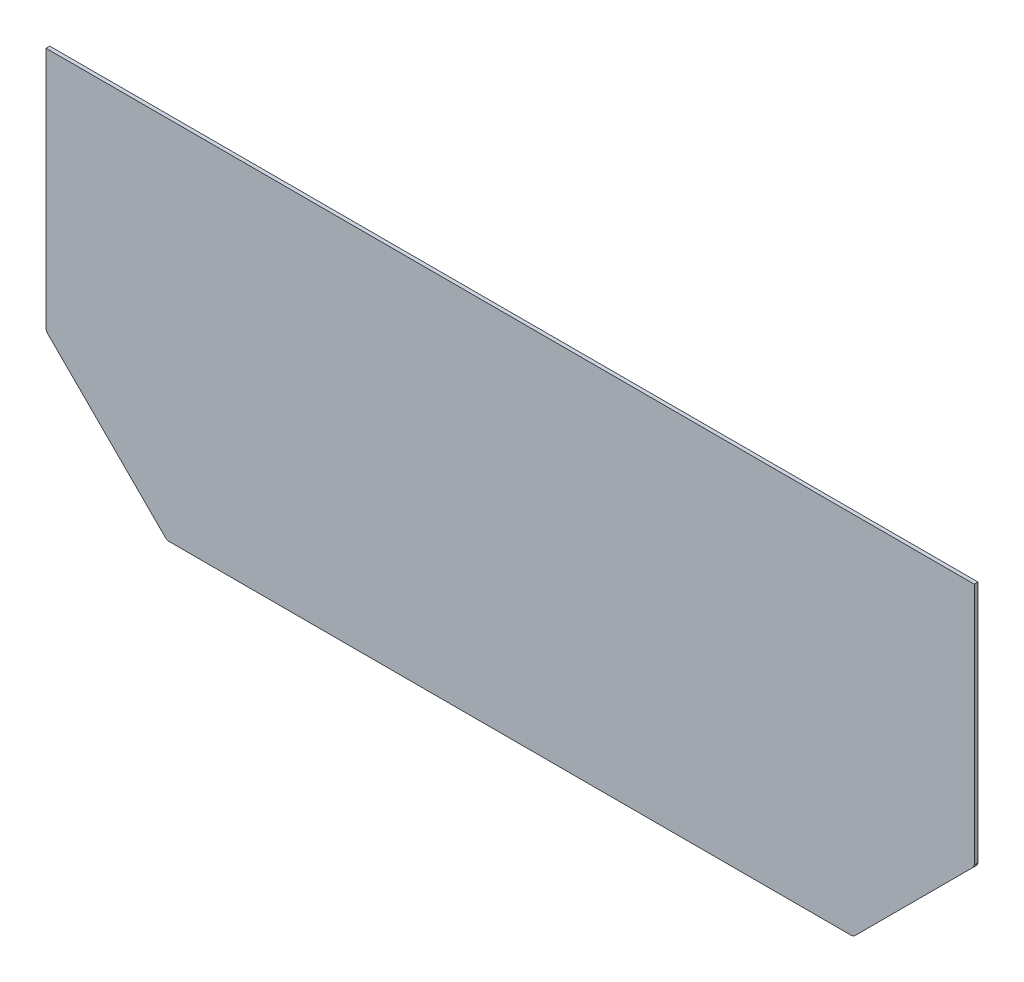
ISO-10303-21;
HEADER;
FILE_DESCRIPTION(('STEP AP214'),'2;1');
FILE_NAME('part.step','',(''),(''),'','','');
FILE_SCHEMA(('AUTOMOTIVE_DESIGN { 1 0 10303 214 1 1 1 1 }'));
ENDSEC;
DATA;
#1=APPLICATION_CONTEXT('core data for automotive mechanical design processes');
#2=APPLICATION_PROTOCOL_DEFINITION('international standard','automotive_design',2000,#1);
#3=PRODUCT_CONTEXT('',#1,'mechanical');
#4=PRODUCT('Part','Part','',(#3));
#5=PRODUCT_RELATED_PRODUCT_CATEGORY('part','',(#4));
#6=PRODUCT_DEFINITION_FORMATION('','',#4);
#7=PRODUCT_DEFINITION_CONTEXT('part definition',#1,'design');
#8=PRODUCT_DEFINITION('design','',#6,#7);
#9=PRODUCT_DEFINITION_SHAPE('','',#8);
#10=(LENGTH_UNIT() NAMED_UNIT(*) SI_UNIT(.MILLI.,.METRE.));
#11=(NAMED_UNIT(*) PLANE_ANGLE_UNIT() SI_UNIT($,.RADIAN.));
#12=(NAMED_UNIT(*) SI_UNIT($,.STERADIAN.) SOLID_ANGLE_UNIT());
#13=UNCERTAINTY_MEASURE_WITH_UNIT(LENGTH_MEASURE(1.E-05),#10,'distance_accuracy_value','');
#14=(GEOMETRIC_REPRESENTATION_CONTEXT(3) GLOBAL_UNCERTAINTY_ASSIGNED_CONTEXT((#13)) GLOBAL_UNIT_ASSIGNED_CONTEXT((#10,
#11,#12)) REPRESENTATION_CONTEXT('',''));
#15=CARTESIAN_POINT('',(0.,0.,0.));
#16=DIRECTION('',(0.,0.,1.));
#17=DIRECTION('',(1.,0.,0.));
#18=AXIS2_PLACEMENT_3D('',#15,#16,#17);
#19=CARTESIAN_POINT('',(-685.090920801277,-304.110479041916,-6.));
#20=DIRECTION('',(-0.382683432365101,-0.923879532511282,0.));
#21=DIRECTION('',(0.923879532511282,-0.382683432365101,0.));
#22=AXIS2_PLACEMENT_3D('',#19,#20,#21);
#23=PLANE('',#22);
#24=DIRECTION('',(0.923879532511282,-0.382683432365101,0.));
#25=VECTOR('',#24,1.);
#26=CARTESIAN_POINT('',(-685.090920801277,-304.110479041916,0.));
#27=LINE('',#26,#25);
#28=CARTESIAN_POINT('',(-689.333561488397,-302.353119729035,0.));
#29=VERTEX_POINT('',#28);
#30=CARTESIAN_POINT('',(-685.090920801277,-304.110479041916,0.));
#31=VERTEX_POINT('',#30);
#32=EDGE_CURVE('E151',#29,#31,#27,.T.);
#33=ORIENTED_EDGE('',*,*,#32,.F.);
#34=DIRECTION('',(0.,0.,1.));
#35=VECTOR('',#34,1.);
#36=CARTESIAN_POINT('',(-689.333561488397,-302.353119729035,-6.));
#37=LINE('',#36,#35);
#38=CARTESIAN_POINT('',(-689.333561488397,-302.353119729035,-6.));
#39=VERTEX_POINT('',#38);
#40=EDGE_CURVE('E11',#39,#29,#37,.T.);
#41=ORIENTED_EDGE('',*,*,#40,.F.);
#42=DIRECTION('',(0.923879532511282,-0.382683432365101,0.));
#43=VECTOR('',#42,1.);
#44=CARTESIAN_POINT('',(-685.090920801277,-304.110479041916,-6.));
#45=LINE('',#44,#43);
#46=CARTESIAN_POINT('',(-685.090920801277,-304.110479041916,-6.));
#47=VERTEX_POINT('',#46);
#48=EDGE_CURVE('E177',#39,#47,#45,.T.);
#49=ORIENTED_EDGE('',*,*,#48,.T.);
#50=DIRECTION('',(0.,0.,1.));
#51=VECTOR('',#50,1.);
#52=CARTESIAN_POINT('',(-685.090920801277,-304.110479041916,-6.));
#53=LINE('',#52,#51);
#54=EDGE_CURVE('E45',#47,#31,#53,.T.);
#55=ORIENTED_EDGE('',*,*,#54,.T.);
#56=EDGE_LOOP('',(#33,#41,#49,#55));
#57=FACE_BOUND('',#56,.T.);
#58=ADVANCED_FACE('F42',(#57),#23,.T.);
#59=CARTESIAN_POINT('',(-689.333561488397,-302.353119729035,-6.));
#60=DIRECTION('',(-0.707106781186548,-0.707106781186547,0.));
#61=DIRECTION('',(0.707106781186547,-0.707106781186548,0.));
#62=AXIS2_PLACEMENT_3D('',#59,#60,#61);
#63=PLANE('',#62);
#64=DIRECTION('',(0.707106781186547,-0.707106781186548,0.));
#65=VECTOR('',#64,1.);
#66=CARTESIAN_POINT('',(-689.333561488397,-302.353119729035,0.));
#67=LINE('',#66,#65);
#68=CARTESIAN_POINT('',(-882.304124236873,-109.382556980558,0.));
#69=VERTEX_POINT('',#68);
#70=EDGE_CURVE('E175',#69,#29,#67,.T.);
#71=ORIENTED_EDGE('',*,*,#70,.F.);
#72=DIRECTION('',(0.,0.,1.));
#73=VECTOR('',#72,1.);
#74=CARTESIAN_POINT('',(-882.304124236873,-109.382556980558,-6.));
#75=LINE('',#74,#73);
#76=CARTESIAN_POINT('',(-882.304124236873,-109.382556980558,-6.));
#77=VERTEX_POINT('',#76);
#78=EDGE_CURVE('E51',#77,#69,#75,.T.);
#79=ORIENTED_EDGE('',*,*,#78,.F.);
#80=DIRECTION('',(0.707106781186547,-0.707106781186548,0.));
#81=VECTOR('',#80,1.);
#82=CARTESIAN_POINT('',(-689.333561488397,-302.353119729035,-6.));
#83=LINE('',#82,#81);
#84=EDGE_CURVE('E141',#77,#39,#83,.T.);
#85=ORIENTED_EDGE('',*,*,#84,.T.);
#86=ORIENTED_EDGE('',*,*,#40,.T.);
#87=EDGE_LOOP('',(#71,#79,#85,#86));
#88=FACE_BOUND('',#87,.T.);
#89=ADVANCED_FACE('F193',(#88),#63,.T.);
#90=CARTESIAN_POINT('',(-882.304124236873,-109.382556980558,-6.));
#91=DIRECTION('',(-0.923879532511294,-0.382683432365072,0.));
#92=DIRECTION('',(0.382683432365072,-0.923879532511294,0.));
#93=AXIS2_PLACEMENT_3D('',#90,#91,#92);
#94=PLANE('',#93);
#95=DIRECTION('',(0.382683432365072,-0.923879532511294,0.));
#96=VECTOR('',#95,1.);
#97=CARTESIAN_POINT('',(-882.304124236873,-109.382556980558,0.));
#98=LINE('',#97,#96);
#99=CARTESIAN_POINT('',(-884.061483549754,-105.139916293439,0.));
#100=VERTEX_POINT('',#99);
#101=EDGE_CURVE('E128',#100,#69,#98,.T.);
#102=ORIENTED_EDGE('',*,*,#101,.F.);
#103=DIRECTION('',(0.,0.,1.));
#104=VECTOR('',#103,1.);
#105=CARTESIAN_POINT('',(-884.061483549754,-105.139916293439,-6.));
#106=LINE('',#105,#104);
#107=CARTESIAN_POINT('',(-884.061483549754,-105.139916293439,-6.));
#108=VERTEX_POINT('',#107);
#109=EDGE_CURVE('E123',#108,#100,#106,.T.);
#110=ORIENTED_EDGE('',*,*,#109,.F.);
#111=DIRECTION('',(0.382683432365072,-0.923879532511294,0.));
#112=VECTOR('',#111,1.);
#113=CARTESIAN_POINT('',(-882.304124236873,-109.382556980558,-6.));
#114=LINE('',#113,#112);
#115=EDGE_CURVE('E126',#108,#77,#114,.T.);
#116=ORIENTED_EDGE('',*,*,#115,.T.);
#117=ORIENTED_EDGE('',*,*,#78,.T.);
#118=EDGE_LOOP('',(#102,#110,#116,#117));
#119=FACE_BOUND('',#118,.T.);
#120=ADVANCED_FACE('F125',(#119),#94,.T.);
#121=CARTESIAN_POINT('',(-884.061483549754,-105.139916293439,-6.));
#122=DIRECTION('',(-1.,0.,0.));
#123=DIRECTION('',(0.,0.,1.));
#124=AXIS2_PLACEMENT_3D('',#121,#122,#123);
#125=PLANE('',#124);
#126=DIRECTION('',(0.,-1.,0.));
#127=VECTOR('',#126,1.);
#128=CARTESIAN_POINT('',(-884.061483549754,-105.139916293439,0.));
#129=LINE('',#128,#127);
#130=CARTESIAN_POINT('',(-884.061483549754,289.889520958084,0.));
#131=VERTEX_POINT('',#130);
#132=EDGE_CURVE('E172',#131,#100,#129,.T.);
#133=ORIENTED_EDGE('',*,*,#132,.F.);
#134=DIRECTION('',(0.,0.,1.));
#135=VECTOR('',#134,1.);
#136=CARTESIAN_POINT('',(-884.061483549754,289.889520958084,-6.));
#137=LINE('',#136,#135);
#138=CARTESIAN_POINT('',(-884.061483549754,289.889520958084,-6.));
#139=VERTEX_POINT('',#138);
#140=EDGE_CURVE('E133',#139,#131,#137,.T.);
#141=ORIENTED_EDGE('',*,*,#140,.F.);
#142=DIRECTION('',(0.,-1.,0.));
#143=VECTOR('',#142,1.);
#144=CARTESIAN_POINT('',(-884.061483549754,-105.139916293439,-6.));
#145=LINE('',#144,#143);
#146=EDGE_CURVE('E139',#139,#108,#145,.T.);
#147=ORIENTED_EDGE('',*,*,#146,.T.);
#148=ORIENTED_EDGE('',*,*,#109,.T.);
#149=EDGE_LOOP('',(#133,#141,#147,#148));
#150=FACE_BOUND('',#149,.T.);
#151=ADVANCED_FACE('F143',(#150),#125,.T.);
#152=CARTESIAN_POINT('',(-884.061483549754,289.889520958084,-6.));
#153=DIRECTION('',(0.,1.,0.));
#154=DIRECTION('',(-1.,0.,0.));
#155=AXIS2_PLACEMENT_3D('',#152,#153,#154);
#156=PLANE('',#155);
#157=DIRECTION('',(-1.,0.,0.));
#158=VECTOR('',#157,1.);
#159=CARTESIAN_POINT('',(-884.061483549754,289.889520958084,0.));
#160=LINE('',#159,#158);
#161=CARTESIAN_POINT('',(623.938516450293,289.889520958084,0.));
#162=VERTEX_POINT('',#161);
#163=EDGE_CURVE('E169',#162,#131,#160,.T.);
#164=ORIENTED_EDGE('',*,*,#163,.F.);
#165=DIRECTION('',(0.,0.,1.));
#166=VECTOR('',#165,1.);
#167=CARTESIAN_POINT('',(623.938516450293,289.889520958084,-6.));
#168=LINE('',#167,#166);
#169=CARTESIAN_POINT('',(623.938516450293,289.889520958084,-6.));
#170=VERTEX_POINT('',#169);
#171=EDGE_CURVE('E181',#170,#162,#168,.T.);
#172=ORIENTED_EDGE('',*,*,#171,.F.);
#173=DIRECTION('',(-1.,0.,0.));
#174=VECTOR('',#173,1.);
#175=CARTESIAN_POINT('',(-884.061483549754,289.889520958084,-6.));
#176=LINE('',#175,#174);
#177=EDGE_CURVE('E144',#170,#139,#176,.T.);
#178=ORIENTED_EDGE('',*,*,#177,.T.);
#179=ORIENTED_EDGE('',*,*,#140,.T.);
#180=EDGE_LOOP('',(#164,#172,#178,#179));
#181=FACE_BOUND('',#180,.T.);
#182=ADVANCED_FACE('F206',(#181),#156,.T.);
#183=CARTESIAN_POINT('',(623.938516450293,-105.139916293439,-6.));
#184=DIRECTION('',(1.,0.,0.));
#185=DIRECTION('',(0.,0.,-1.));
#186=AXIS2_PLACEMENT_3D('',#183,#184,#185);
#187=PLANE('',#186);
#188=DIRECTION('',(0.,1.,0.));
#189=VECTOR('',#188,1.);
#190=CARTESIAN_POINT('',(623.938516450293,-105.139916293439,0.));
#191=LINE('',#190,#189);
#192=CARTESIAN_POINT('',(623.938516450293,-105.139916293439,0.));
#193=VERTEX_POINT('',#192);
#194=EDGE_CURVE('E166',#193,#162,#191,.T.);
#195=ORIENTED_EDGE('',*,*,#194,.F.);
#196=DIRECTION('',(0.,0.,1.));
#197=VECTOR('',#196,1.);
#198=CARTESIAN_POINT('',(623.938516450293,-105.139916293439,-6.));
#199=LINE('',#198,#197);
#200=CARTESIAN_POINT('',(623.938516450293,-105.139916293439,-6.));
#201=VERTEX_POINT('',#200);
#202=EDGE_CURVE('E183',#201,#193,#199,.T.);
#203=ORIENTED_EDGE('',*,*,#202,.F.);
#204=DIRECTION('',(0.,1.,0.));
#205=VECTOR('',#204,1.);
#206=CARTESIAN_POINT('',(623.938516450293,-105.139916293439,-6.));
#207=LINE('',#206,#205);
#208=EDGE_CURVE('E146',#201,#170,#207,.T.);
#209=ORIENTED_EDGE('',*,*,#208,.T.);
#210=ORIENTED_EDGE('',*,*,#171,.T.);
#211=EDGE_LOOP('',(#195,#203,#209,#210));
#212=FACE_BOUND('',#211,.T.);
#213=ADVANCED_FACE('F209',(#212),#187,.T.);
#214=CARTESIAN_POINT('',(622.181157137412,-109.382556980559,-6.));
#215=DIRECTION('',(0.923879532511295,-0.382683432365069,0.));
#216=DIRECTION('',(0.382683432365069,0.923879532511295,0.));
#217=AXIS2_PLACEMENT_3D('',#214,#215,#216);
#218=PLANE('',#217);
#219=DIRECTION('',(0.382683432365069,0.923879532511295,0.));
#220=VECTOR('',#219,1.);
#221=CARTESIAN_POINT('',(622.181157137412,-109.382556980559,0.));
#222=LINE('',#221,#220);
#223=CARTESIAN_POINT('',(622.181157137412,-109.382556980559,0.));
#224=VERTEX_POINT('',#223);
#225=EDGE_CURVE('E163',#224,#193,#222,.T.);
#226=ORIENTED_EDGE('',*,*,#225,.F.);
#227=DIRECTION('',(0.,0.,1.));
#228=VECTOR('',#227,1.);
#229=CARTESIAN_POINT('',(622.181157137412,-109.382556980559,-6.));
#230=LINE('',#229,#228);
#231=CARTESIAN_POINT('',(622.181157137412,-109.382556980559,-6.));
#232=VERTEX_POINT('',#231);
#233=EDGE_CURVE('E185',#232,#224,#230,.T.);
#234=ORIENTED_EDGE('',*,*,#233,.F.);
#235=DIRECTION('',(0.382683432365069,0.923879532511295,0.));
#236=VECTOR('',#235,1.);
#237=CARTESIAN_POINT('',(622.181157137412,-109.382556980559,-6.));
#238=LINE('',#237,#236);
#239=EDGE_CURVE('E332',#232,#201,#238,.T.);
#240=ORIENTED_EDGE('',*,*,#239,.T.);
#241=ORIENTED_EDGE('',*,*,#202,.T.);
#242=EDGE_LOOP('',(#226,#234,#240,#241));
#243=FACE_BOUND('',#242,.T.);
#244=ADVANCED_FACE('F213',(#243),#218,.T.);
#245=CARTESIAN_POINT('',(429.210594388935,-302.353119729035,-6.));
#246=DIRECTION('',(0.707106781186548,-0.707106781186547,0.));
#247=DIRECTION('',(0.707106781186547,0.707106781186548,0.));
#248=AXIS2_PLACEMENT_3D('',#245,#246,#247);
#249=PLANE('',#248);
#250=DIRECTION('',(0.707106781186547,0.707106781186548,0.));
#251=VECTOR('',#250,1.);
#252=CARTESIAN_POINT('',(429.210594388935,-302.353119729035,0.));
#253=LINE('',#252,#251);
#254=CARTESIAN_POINT('',(429.210594388935,-302.353119729035,0.));
#255=VERTEX_POINT('',#254);
#256=EDGE_CURVE('E160',#255,#224,#253,.T.);
#257=ORIENTED_EDGE('',*,*,#256,.F.);
#258=DIRECTION('',(0.,0.,1.));
#259=VECTOR('',#258,1.);
#260=CARTESIAN_POINT('',(429.210594388935,-302.353119729035,-6.));
#261=LINE('',#260,#259);
#262=CARTESIAN_POINT('',(429.210594388935,-302.353119729035,-6.));
#263=VERTEX_POINT('',#262);
#264=EDGE_CURVE('E187',#263,#255,#261,.T.);
#265=ORIENTED_EDGE('',*,*,#264,.F.);
#266=DIRECTION('',(0.707106781186547,0.707106781186548,0.));
#267=VECTOR('',#266,1.);
#268=CARTESIAN_POINT('',(429.210594388935,-302.353119729035,-6.));
#269=LINE('',#268,#267);
#270=EDGE_CURVE('E328',#263,#232,#269,.T.);
#271=ORIENTED_EDGE('',*,*,#270,.T.);
#272=ORIENTED_EDGE('',*,*,#233,.T.);
#273=EDGE_LOOP('',(#257,#265,#271,#272));
#274=FACE_BOUND('',#273,.T.);
#275=ADVANCED_FACE('F217',(#274),#249,.T.);
#276=CARTESIAN_POINT('',(424.967953701816,-304.110479041916,-6.));
#277=DIRECTION('',(0.382683432365118,-0.923879532511275,0.));
#278=DIRECTION('',(0.923879532511275,0.382683432365118,0.));
#279=AXIS2_PLACEMENT_3D('',#276,#277,#278);
#280=PLANE('',#279);
#281=DIRECTION('',(0.923879532511275,0.382683432365118,0.));
#282=VECTOR('',#281,1.);
#283=CARTESIAN_POINT('',(424.967953701816,-304.110479041916,0.));
#284=LINE('',#283,#282);
#285=CARTESIAN_POINT('',(424.967953701816,-304.110479041916,0.));
#286=VERTEX_POINT('',#285);
#287=EDGE_CURVE('E157',#286,#255,#284,.T.);
#288=ORIENTED_EDGE('',*,*,#287,.F.);
#289=DIRECTION('',(0.,0.,1.));
#290=VECTOR('',#289,1.);
#291=CARTESIAN_POINT('',(424.967953701816,-304.110479041916,-6.));
#292=LINE('',#291,#290);
#293=CARTESIAN_POINT('',(424.967953701816,-304.110479041916,-6.));
#294=VERTEX_POINT('',#293);
#295=EDGE_CURVE('E188',#294,#286,#292,.T.);
#296=ORIENTED_EDGE('',*,*,#295,.F.);
#297=DIRECTION('',(0.923879532511275,0.382683432365118,0.));
#298=VECTOR('',#297,1.);
#299=CARTESIAN_POINT('',(424.967953701816,-304.110479041916,-6.));
#300=LINE('',#299,#298);
#301=EDGE_CURVE('E339',#294,#263,#300,.T.);
#302=ORIENTED_EDGE('',*,*,#301,.T.);
#303=ORIENTED_EDGE('',*,*,#264,.T.);
#304=EDGE_LOOP('',(#288,#296,#302,#303));
#305=FACE_BOUND('',#304,.T.);
#306=ADVANCED_FACE('F221',(#305),#280,.T.);
#307=CARTESIAN_POINT('',(-685.090920801277,-304.110479041916,-6.));
#308=DIRECTION('',(0.,-1.,0.));
#309=DIRECTION('',(1.,0.,0.));
#310=AXIS2_PLACEMENT_3D('',#307,#308,#309);
#311=PLANE('',#310);
#312=DIRECTION('',(1.,0.,0.));
#313=VECTOR('',#312,1.);
#314=CARTESIAN_POINT('',(-685.090920801277,-304.110479041916,0.));
#315=LINE('',#314,#313);
#316=EDGE_CURVE('E154',#31,#286,#315,.T.);
#317=ORIENTED_EDGE('',*,*,#316,.F.);
#318=ORIENTED_EDGE('',*,*,#54,.F.);
#319=DIRECTION('',(1.,0.,0.));
#320=VECTOR('',#319,1.);
#321=CARTESIAN_POINT('',(-685.090920801277,-304.110479041916,-6.));
#322=LINE('',#321,#320);
#323=EDGE_CURVE('E341',#47,#294,#322,.T.);
#324=ORIENTED_EDGE('',*,*,#323,.T.);
#325=ORIENTED_EDGE('',*,*,#295,.T.);
#326=EDGE_LOOP('',(#317,#318,#324,#325));
#327=FACE_BOUND('',#326,.T.);
#328=ADVANCED_FACE('F190',(#327),#311,.T.);
#329=CARTESIAN_POINT('',(0.,0.,-6.));
#330=DIRECTION('',(0.,0.,-1.));
#331=DIRECTION('',(-1.,0.,0.));
#332=AXIS2_PLACEMENT_3D('',#329,#330,#331);
#333=PLANE('',#332);
#334=ORIENTED_EDGE('',*,*,#48,.F.);
#335=ORIENTED_EDGE('',*,*,#84,.F.);
#336=ORIENTED_EDGE('',*,*,#115,.F.);
#337=ORIENTED_EDGE('',*,*,#146,.F.);
#338=ORIENTED_EDGE('',*,*,#177,.F.);
#339=ORIENTED_EDGE('',*,*,#208,.F.);
#340=ORIENTED_EDGE('',*,*,#239,.F.);
#341=ORIENTED_EDGE('',*,*,#270,.F.);
#342=ORIENTED_EDGE('',*,*,#301,.F.);
#343=ORIENTED_EDGE('',*,*,#323,.F.);
#344=EDGE_LOOP('',(#334,#335,#336,#337,#338,#339,#340,#341,#342,#343));
#345=FACE_BOUND('',#344,.T.);
#346=ADVANCED_FACE('F137',(#345),#333,.T.);
#347=CARTESIAN_POINT('',(0.,0.,0.));
#348=DIRECTION('',(0.,0.,-1.));
#349=DIRECTION('',(-1.,0.,0.));
#350=AXIS2_PLACEMENT_3D('',#347,#348,#349);
#351=PLANE('',#350);
#352=ORIENTED_EDGE('',*,*,#32,.T.);
#353=ORIENTED_EDGE('',*,*,#316,.T.);
#354=ORIENTED_EDGE('',*,*,#287,.T.);
#355=ORIENTED_EDGE('',*,*,#256,.T.);
#356=ORIENTED_EDGE('',*,*,#225,.T.);
#357=ORIENTED_EDGE('',*,*,#194,.T.);
#358=ORIENTED_EDGE('',*,*,#163,.T.);
#359=ORIENTED_EDGE('',*,*,#132,.T.);
#360=ORIENTED_EDGE('',*,*,#101,.T.);
#361=ORIENTED_EDGE('',*,*,#70,.T.);
#362=EDGE_LOOP('',(#352,#353,#354,#355,#356,#357,#358,#359,#360,#361));
#363=FACE_BOUND('',#362,.T.);
#364=ADVANCED_FACE('F192',(#363),#351,.F.);
#365=CLOSED_SHELL('',(#58,#89,#120,#151,#182,#213,#244,#275,#306,#328,#346,#364));
#366=MANIFOLD_SOLID_BREP('B2',#365);
#367=ADVANCED_BREP_SHAPE_REPRESENTATION('',(#18,#366),#14);
#368=SHAPE_DEFINITION_REPRESENTATION(#9,#367);
ENDSEC;
END-ISO-10303-21;
